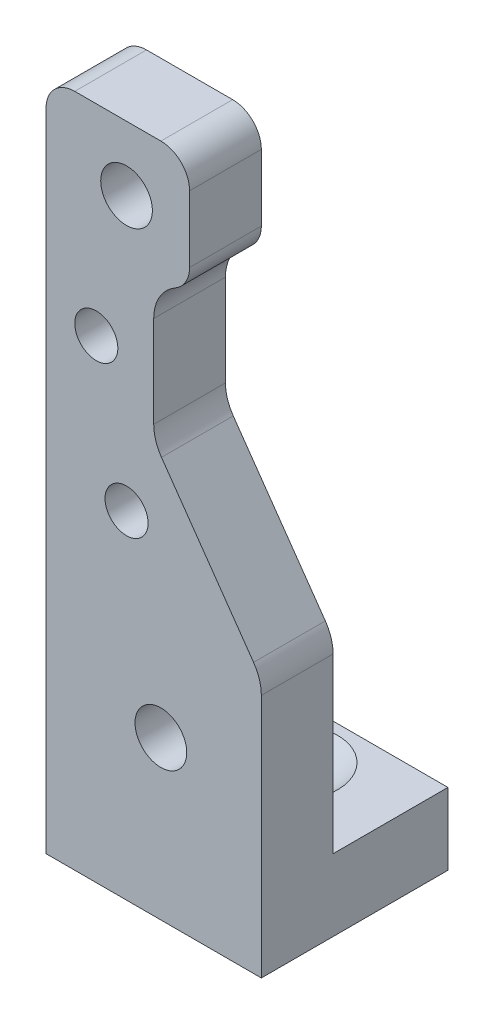
ISO-10303-21;
HEADER;
FILE_DESCRIPTION(('STEP AP214'),'2;1');
FILE_NAME('part.step','',(''),(''),'','','');
FILE_SCHEMA(('AUTOMOTIVE_DESIGN { 1 0 10303 214 1 1 1 1 }'));
ENDSEC;
DATA;
#1=APPLICATION_CONTEXT('core data for automotive mechanical design processes');
#2=APPLICATION_PROTOCOL_DEFINITION('international standard','automotive_design',2000,#1);
#3=PRODUCT_CONTEXT('',#1,'mechanical');
#4=PRODUCT('Part','Part','',(#3));
#5=PRODUCT_RELATED_PRODUCT_CATEGORY('part','',(#4));
#6=PRODUCT_DEFINITION_FORMATION('','',#4);
#7=PRODUCT_DEFINITION_CONTEXT('part definition',#1,'design');
#8=PRODUCT_DEFINITION('design','',#6,#7);
#9=PRODUCT_DEFINITION_SHAPE('','',#8);
#10=(LENGTH_UNIT() NAMED_UNIT(*) SI_UNIT(.MILLI.,.METRE.));
#11=(NAMED_UNIT(*) PLANE_ANGLE_UNIT() SI_UNIT($,.RADIAN.));
#12=(NAMED_UNIT(*) SI_UNIT($,.STERADIAN.) SOLID_ANGLE_UNIT());
#13=UNCERTAINTY_MEASURE_WITH_UNIT(LENGTH_MEASURE(1.E-05),#10,'distance_accuracy_value','');
#14=(GEOMETRIC_REPRESENTATION_CONTEXT(3) GLOBAL_UNCERTAINTY_ASSIGNED_CONTEXT((#13)) GLOBAL_UNIT_ASSIGNED_CONTEXT((#10,
#11,#12)) REPRESENTATION_CONTEXT('',''));
#15=CARTESIAN_POINT('',(0.,0.,0.));
#16=DIRECTION('',(0.,0.,1.));
#17=DIRECTION('',(1.,0.,0.));
#18=AXIS2_PLACEMENT_3D('',#15,#16,#17);
#19=CARTESIAN_POINT('',(-5.,5.,-13.));
#20=DIRECTION('',(0.,1.,0.));
#21=DIRECTION('',(0.,0.,1.));
#22=AXIS2_PLACEMENT_3D('',#19,#20,#21);
#23=PLANE('',#22);
#24=CARTESIAN_POINT('',(3.,5.,-9.));
#25=DIRECTION('',(0.,1.,0.));
#26=DIRECTION('',(0.,0.,1.));
#27=AXIS2_PLACEMENT_3D('',#24,#25,#26);
#28=CIRCLE('',#27,3.3);
#29=CARTESIAN_POINT('',(3.,5.,-5.7));
#30=VERTEX_POINT('',#29);
#31=EDGE_CURVE('E323',#30,#30,#28,.T.);
#32=ORIENTED_EDGE('',*,*,#31,.F.);
#33=EDGE_LOOP('',(#32));
#34=FACE_BOUND('',#33,.T.);
#35=DIRECTION('',(1.,0.,0.));
#36=VECTOR('',#35,1.);
#37=CARTESIAN_POINT('',(-5.,5.,-13.));
#38=LINE('',#37,#36);
#39=CARTESIAN_POINT('',(-2.,5.,-13.));
#40=VERTEX_POINT('',#39);
#41=CARTESIAN_POINT('',(10.,5.,-13.));
#42=VERTEX_POINT('',#41);
#43=EDGE_CURVE('E197',#40,#42,#38,.T.);
#44=ORIENTED_EDGE('',*,*,#43,.F.);
#45=DIRECTION('',(0.,0.,1.));
#46=VECTOR('',#45,1.);
#47=CARTESIAN_POINT('',(-2.,5.,-13.));
#48=LINE('',#47,#46);
#49=CARTESIAN_POINT('',(-2.,5.,-5.));
#50=VERTEX_POINT('',#49);
#51=EDGE_CURVE('E276',#40,#50,#48,.T.);
#52=ORIENTED_EDGE('',*,*,#51,.T.);
#53=DIRECTION('',(1.,0.,0.));
#54=VECTOR('',#53,1.);
#55=CARTESIAN_POINT('',(-5.,5.,-5.));
#56=LINE('',#55,#54);
#57=CARTESIAN_POINT('',(10.,5.,-5.));
#58=VERTEX_POINT('',#57);
#59=EDGE_CURVE('E192',#50,#58,#56,.T.);
#60=ORIENTED_EDGE('',*,*,#59,.T.);
#61=DIRECTION('',(0.,0.,1.));
#62=VECTOR('',#61,1.);
#63=CARTESIAN_POINT('',(10.,5.,-13.));
#64=LINE('',#63,#62);
#65=EDGE_CURVE('E177',#42,#58,#64,.T.);
#66=ORIENTED_EDGE('',*,*,#65,.F.);
#67=EDGE_LOOP('',(#44,#52,#60,#66));
#68=FACE_BOUND('',#67,.T.);
#69=ADVANCED_FACE('F33',(#34,#68),#23,.T.);
#70=CARTESIAN_POINT('',(-5.,0.,0.));
#71=DIRECTION('',(0.,0.,1.));
#72=DIRECTION('',(1.,0.,0.));
#73=AXIS2_PLACEMENT_3D('',#70,#71,#72);
#74=PLANE('',#73);
#75=CARTESIAN_POINT('',(-1.50000000000001,33.,0.));
#76=DIRECTION('',(0.,0.,-1.));
#77=DIRECTION('',(-1.,0.,0.));
#78=AXIS2_PLACEMENT_3D('',#75,#76,#77);
#79=CIRCLE('',#78,1.49999999999999);
#80=CARTESIAN_POINT('',(-3.,33.,0.));
#81=VERTEX_POINT('',#80);
#82=EDGE_CURVE('E311',#81,#81,#79,.T.);
#83=ORIENTED_EDGE('',*,*,#82,.T.);
#84=EDGE_LOOP('',(#83));
#85=FACE_BOUND('',#84,.T.);
#86=CARTESIAN_POINT('',(0.608074791675382,23.4910891108342,0.));
#87=DIRECTION('',(0.,0.,-1.));
#88=DIRECTION('',(-1.,0.,0.));
#89=AXIS2_PLACEMENT_3D('',#86,#87,#88);
#90=CIRCLE('',#89,1.49999999999999);
#91=CARTESIAN_POINT('',(-0.891925208324605,23.4910891108342,0.));
#92=VERTEX_POINT('',#91);
#93=EDGE_CURVE('E305',#92,#92,#90,.T.);
#94=ORIENTED_EDGE('',*,*,#93,.T.);
#95=EDGE_LOOP('',(#94));
#96=FACE_BOUND('',#95,.T.);
#97=CARTESIAN_POINT('',(3.,11.,0.));
#98=DIRECTION('',(0.,0.,-1.));
#99=DIRECTION('',(-1.,0.,0.));
#100=AXIS2_PLACEMENT_3D('',#97,#98,#99);
#101=CIRCLE('',#100,1.8);
#102=CARTESIAN_POINT('',(1.2,11.,0.));
#103=VERTEX_POINT('',#102);
#104=EDGE_CURVE('E296',#103,#103,#101,.T.);
#105=ORIENTED_EDGE('',*,*,#104,.T.);
#106=EDGE_LOOP('',(#105));
#107=FACE_BOUND('',#106,.T.);
#108=CARTESIAN_POINT('',(0.608074791675382,42.5089108891658,0.));
#109=DIRECTION('',(0.,0.,-1.));
#110=DIRECTION('',(-1.,0.,0.));
#111=AXIS2_PLACEMENT_3D('',#108,#109,#110);
#112=CIRCLE('',#111,1.8);
#113=CARTESIAN_POINT('',(-1.19192520832462,42.5089108891658,0.));
#114=VERTEX_POINT('',#113);
#115=EDGE_CURVE('E285',#114,#114,#112,.T.);
#116=ORIENTED_EDGE('',*,*,#115,.T.);
#117=EDGE_LOOP('',(#116));
#118=FACE_BOUND('',#117,.T.);
#119=DIRECTION('',(1.,0.,0.));
#120=VECTOR('',#119,1.);
#121=CARTESIAN_POINT('',(-5.,47.,0.));
#122=LINE('',#121,#120);
#123=CARTESIAN_POINT('',(-3.,47.,0.));
#124=VERTEX_POINT('',#123);
#125=CARTESIAN_POINT('',(3.,47.,0.));
#126=VERTEX_POINT('',#125);
#127=EDGE_CURVE('E267',#124,#126,#122,.T.);
#128=ORIENTED_EDGE('',*,*,#127,.F.);
#129=CARTESIAN_POINT('',(-3.,45.,0.));
#130=DIRECTION('',(0.,0.,1.));
#131=DIRECTION('',(1.,0.,0.));
#132=AXIS2_PLACEMENT_3D('',#129,#130,#131);
#133=CIRCLE('',#132,2.);
#134=CARTESIAN_POINT('',(-5.,45.,0.));
#135=VERTEX_POINT('',#134);
#136=EDGE_CURVE('E238',#124,#135,#133,.T.);
#137=ORIENTED_EDGE('',*,*,#136,.T.);
#138=DIRECTION('',(0.,-1.,0.));
#139=VECTOR('',#138,1.);
#140=CARTESIAN_POINT('',(-5.,0.,0.));
#141=LINE('',#140,#139);
#142=CARTESIAN_POINT('',(-5.,0.,0.));
#143=VERTEX_POINT('',#142);
#144=EDGE_CURVE('E167',#135,#143,#141,.T.);
#145=ORIENTED_EDGE('',*,*,#144,.T.);
#146=DIRECTION('',(1.,0.,0.));
#147=VECTOR('',#146,1.);
#148=CARTESIAN_POINT('',(-5.,0.,0.));
#149=LINE('',#148,#147);
#150=CARTESIAN_POINT('',(10.,0.,0.));
#151=VERTEX_POINT('',#150);
#152=EDGE_CURVE('E163',#143,#151,#149,.T.);
#153=ORIENTED_EDGE('',*,*,#152,.T.);
#154=DIRECTION('',(0.,-1.,0.));
#155=VECTOR('',#154,1.);
#156=CARTESIAN_POINT('',(10.,0.,0.));
#157=LINE('',#156,#155);
#158=CARTESIAN_POINT('',(10.,17.054103633363,0.));
#159=VERTEX_POINT('',#158);
#160=EDGE_CURVE('E150',#159,#151,#157,.T.);
#161=ORIENTED_EDGE('',*,*,#160,.F.);
#162=CARTESIAN_POINT('',(7.,17.054103633363,0.));
#163=DIRECTION('',(0.,0.,1.));
#164=DIRECTION('',(1.,0.,0.));
#165=AXIS2_PLACEMENT_3D('',#162,#163,#164);
#166=CIRCLE('',#165,3.);
#167=CARTESIAN_POINT('',(9.45745613286697,18.7748329424162,0.));
#168=VERTEX_POINT('',#167);
#169=EDGE_CURVE('E200',#159,#168,#166,.T.);
#170=ORIENTED_EDGE('',*,*,#169,.T.);
#171=DIRECTION('',(0.57357643635105,-0.819152044288989,0.));
#172=VECTOR('',#171,1.);
#173=CARTESIAN_POINT('',(2.5,28.7111100505657,0.));
#174=LINE('',#173,#172);
#175=CARTESIAN_POINT('',(3.04254386713303,27.9362771081496,0.));
#176=VERTEX_POINT('',#175);
#177=EDGE_CURVE('E160',#176,#168,#174,.T.);
#178=ORIENTED_EDGE('',*,*,#177,.F.);
#179=CARTESIAN_POINT('',(5.5,29.6570064172027,0.));
#180=DIRECTION('',(0.,0.,1.));
#181=DIRECTION('',(1.,0.,0.));
#182=AXIS2_PLACEMENT_3D('',#179,#180,#181);
#183=CIRCLE('',#182,3.);
#184=CARTESIAN_POINT('',(2.5,29.6570064172027,0.));
#185=VERTEX_POINT('',#184);
#186=EDGE_CURVE('E215',#176,#185,#183,.F.);
#187=ORIENTED_EDGE('',*,*,#186,.T.);
#188=DIRECTION('',(0.,-1.,0.));
#189=VECTOR('',#188,1.);
#190=CARTESIAN_POINT('',(2.5,39.,0.));
#191=LINE('',#190,#189);
#192=CARTESIAN_POINT('',(2.5,36.0419601084502,0.));
#193=VERTEX_POINT('',#192);
#194=EDGE_CURVE('E264',#193,#185,#191,.T.);
#195=ORIENTED_EDGE('',*,*,#194,.F.);
#196=CARTESIAN_POINT('',(5.5,36.0419601084502,0.));
#197=DIRECTION('',(0.,0.,1.));
#198=DIRECTION('',(1.,0.,0.));
#199=AXIS2_PLACEMENT_3D('',#196,#197,#198);
#200=CIRCLE('',#199,3.);
#201=CARTESIAN_POINT('',(4.,38.6400363198035,0.));
#202=VERTEX_POINT('',#201);
#203=EDGE_CURVE('E219',#193,#202,#200,.F.);
#204=ORIENTED_EDGE('',*,*,#203,.T.);
#205=CARTESIAN_POINT('',(3.,40.3720871273724,0.));
#206=DIRECTION('',(0.,0.,1.));
#207=DIRECTION('',(1.,0.,0.));
#208=AXIS2_PLACEMENT_3D('',#205,#206,#207);
#209=CIRCLE('',#208,2.);
#210=CARTESIAN_POINT('',(5.,40.3720871273724,0.));
#211=VERTEX_POINT('',#210);
#212=EDGE_CURVE('E48',#202,#211,#209,.T.);
#213=ORIENTED_EDGE('',*,*,#212,.T.);
#214=DIRECTION('',(0.,-1.,0.));
#215=VECTOR('',#214,1.);
#216=CARTESIAN_POINT('',(5.,47.,0.));
#217=LINE('',#216,#215);
#218=CARTESIAN_POINT('',(5.,45.,0.));
#219=VERTEX_POINT('',#218);
#220=EDGE_CURVE('E246',#219,#211,#217,.T.);
#221=ORIENTED_EDGE('',*,*,#220,.F.);
#222=CARTESIAN_POINT('',(3.,45.,0.));
#223=DIRECTION('',(0.,0.,1.));
#224=DIRECTION('',(1.,0.,0.));
#225=AXIS2_PLACEMENT_3D('',#222,#223,#224);
#226=CIRCLE('',#225,2.);
#227=EDGE_CURVE('E236',#219,#126,#226,.T.);
#228=ORIENTED_EDGE('',*,*,#227,.T.);
#229=EDGE_LOOP('',(#128,#137,#145,#153,#161,#170,#178,#187,#195,#204,#213,#221,#228));
#230=FACE_BOUND('',#229,.T.);
#231=ADVANCED_FACE('F165',(#85,#96,#107,#118,#230),#74,.T.);
#232=CARTESIAN_POINT('',(-5.,5.,-5.));
#233=DIRECTION('',(0.,0.,-1.));
#234=DIRECTION('',(-1.,0.,0.));
#235=AXIS2_PLACEMENT_3D('',#232,#233,#234);
#236=PLANE('',#235);
#237=CARTESIAN_POINT('',(-1.50000000000001,33.,-5.));
#238=DIRECTION('',(0.,0.,-1.));
#239=DIRECTION('',(-1.,0.,0.));
#240=AXIS2_PLACEMENT_3D('',#237,#238,#239);
#241=CIRCLE('',#240,1.49999999999999);
#242=CARTESIAN_POINT('',(-3.,33.,-5.));
#243=VERTEX_POINT('',#242);
#244=EDGE_CURVE('E314',#243,#243,#241,.T.);
#245=ORIENTED_EDGE('',*,*,#244,.F.);
#246=EDGE_LOOP('',(#245));
#247=FACE_BOUND('',#246,.T.);
#248=CARTESIAN_POINT('',(0.608074791675382,23.4910891108342,-5.));
#249=DIRECTION('',(0.,0.,-1.));
#250=DIRECTION('',(-1.,0.,0.));
#251=AXIS2_PLACEMENT_3D('',#248,#249,#250);
#252=CIRCLE('',#251,1.49999999999999);
#253=CARTESIAN_POINT('',(-0.891925208324606,23.4910891108342,-5.));
#254=VERTEX_POINT('',#253);
#255=EDGE_CURVE('E308',#254,#254,#252,.T.);
#256=ORIENTED_EDGE('',*,*,#255,.F.);
#257=EDGE_LOOP('',(#256));
#258=FACE_BOUND('',#257,.T.);
#259=CARTESIAN_POINT('',(3.,11.,-5.));
#260=DIRECTION('',(0.,0.,-1.));
#261=DIRECTION('',(-1.,0.,0.));
#262=AXIS2_PLACEMENT_3D('',#259,#260,#261);
#263=CIRCLE('',#262,3.3);
#264=CARTESIAN_POINT('',(-0.300000000000001,11.,-5.));
#265=VERTEX_POINT('',#264);
#266=EDGE_CURVE('E302',#265,#265,#263,.T.);
#267=ORIENTED_EDGE('',*,*,#266,.F.);
#268=EDGE_LOOP('',(#267));
#269=FACE_BOUND('',#268,.T.);
#270=CARTESIAN_POINT('',(0.608074791675382,42.5089108891658,-5.));
#271=DIRECTION('',(0.,0.,-1.));
#272=DIRECTION('',(-1.,0.,0.));
#273=AXIS2_PLACEMENT_3D('',#270,#271,#272);
#274=CIRCLE('',#273,3.3);
#275=CARTESIAN_POINT('',(-2.69192520832462,42.5089108891658,-5.));
#276=VERTEX_POINT('',#275);
#277=EDGE_CURVE('E293',#276,#276,#274,.T.);
#278=ORIENTED_EDGE('',*,*,#277,.F.);
#279=EDGE_LOOP('',(#278));
#280=FACE_BOUND('',#279,.T.);
#281=DIRECTION('',(0.,1.,0.));
#282=VECTOR('',#281,1.);
#283=CARTESIAN_POINT('',(-5.,5.,-5.));
#284=LINE('',#283,#282);
#285=CARTESIAN_POINT('',(-5.,15.,-5.));
#286=VERTEX_POINT('',#285);
#287=CARTESIAN_POINT('',(-5.,45.,-5.));
#288=VERTEX_POINT('',#287);
#289=EDGE_CURVE('E172',#286,#288,#284,.T.);
#290=ORIENTED_EDGE('',*,*,#289,.T.);
#291=CARTESIAN_POINT('',(-3.,45.,-5.));
#292=DIRECTION('',(0.,0.,-1.));
#293=DIRECTION('',(-1.,0.,0.));
#294=AXIS2_PLACEMENT_3D('',#291,#292,#293);
#295=CIRCLE('',#294,2.);
#296=CARTESIAN_POINT('',(-3.,47.,-5.));
#297=VERTEX_POINT('',#296);
#298=EDGE_CURVE('E228',#288,#297,#295,.T.);
#299=ORIENTED_EDGE('',*,*,#298,.T.);
#300=DIRECTION('',(1.,0.,0.));
#301=VECTOR('',#300,1.);
#302=CARTESIAN_POINT('',(-5.,47.,-5.));
#303=LINE('',#302,#301);
#304=CARTESIAN_POINT('',(3.,47.,-5.));
#305=VERTEX_POINT('',#304);
#306=EDGE_CURVE('E253',#297,#305,#303,.T.);
#307=ORIENTED_EDGE('',*,*,#306,.T.);
#308=CARTESIAN_POINT('',(3.,45.,-5.));
#309=DIRECTION('',(0.,0.,-1.));
#310=DIRECTION('',(-1.,0.,0.));
#311=AXIS2_PLACEMENT_3D('',#308,#309,#310);
#312=CIRCLE('',#311,2.);
#313=CARTESIAN_POINT('',(5.,45.,-5.));
#314=VERTEX_POINT('',#313);
#315=EDGE_CURVE('E226',#305,#314,#312,.T.);
#316=ORIENTED_EDGE('',*,*,#315,.T.);
#317=DIRECTION('',(0.,-1.,0.));
#318=VECTOR('',#317,1.);
#319=CARTESIAN_POINT('',(5.,47.,-5.));
#320=LINE('',#319,#318);
#321=CARTESIAN_POINT('',(5.,40.3720871273724,-5.));
#322=VERTEX_POINT('',#321);
#323=EDGE_CURVE('E245',#314,#322,#320,.T.);
#324=ORIENTED_EDGE('',*,*,#323,.T.);
#325=CARTESIAN_POINT('',(3.,40.3720871273724,-5.));
#326=DIRECTION('',(0.,0.,-1.));
#327=DIRECTION('',(-1.,0.,0.));
#328=AXIS2_PLACEMENT_3D('',#325,#326,#327);
#329=CIRCLE('',#328,2.);
#330=CARTESIAN_POINT('',(4.,38.6400363198035,-5.));
#331=VERTEX_POINT('',#330);
#332=EDGE_CURVE('E224',#322,#331,#329,.T.);
#333=ORIENTED_EDGE('',*,*,#332,.T.);
#334=CARTESIAN_POINT('',(5.5,36.0419601084502,-5.));
#335=DIRECTION('',(0.,0.,-1.));
#336=DIRECTION('',(-1.,0.,0.));
#337=AXIS2_PLACEMENT_3D('',#334,#335,#336);
#338=CIRCLE('',#337,3.);
#339=CARTESIAN_POINT('',(2.5,36.0419601084502,-5.));
#340=VERTEX_POINT('',#339);
#341=EDGE_CURVE('E217',#331,#340,#338,.F.);
#342=ORIENTED_EDGE('',*,*,#341,.T.);
#343=DIRECTION('',(0.,-1.,0.));
#344=VECTOR('',#343,1.);
#345=CARTESIAN_POINT('',(2.5,39.,-5.));
#346=LINE('',#345,#344);
#347=CARTESIAN_POINT('',(2.5,29.6570064172027,-5.));
#348=VERTEX_POINT('',#347);
#349=EDGE_CURVE('E252',#340,#348,#346,.T.);
#350=ORIENTED_EDGE('',*,*,#349,.T.);
#351=CARTESIAN_POINT('',(5.5,29.6570064172027,-5.));
#352=DIRECTION('',(0.,0.,-1.));
#353=DIRECTION('',(-1.,0.,0.));
#354=AXIS2_PLACEMENT_3D('',#351,#352,#353);
#355=CIRCLE('',#354,3.);
#356=CARTESIAN_POINT('',(3.04254386713303,27.9362771081496,-5.));
#357=VERTEX_POINT('',#356);
#358=EDGE_CURVE('E213',#348,#357,#355,.F.);
#359=ORIENTED_EDGE('',*,*,#358,.T.);
#360=DIRECTION('',(0.57357643635105,-0.819152044288989,0.));
#361=VECTOR('',#360,1.);
#362=CARTESIAN_POINT('',(2.5,28.7111100505657,-5.));
#363=LINE('',#362,#361);
#364=CARTESIAN_POINT('',(9.45745613286697,18.7748329424162,-5.));
#365=VERTEX_POINT('',#364);
#366=EDGE_CURVE('E256',#357,#365,#363,.T.);
#367=ORIENTED_EDGE('',*,*,#366,.T.);
#368=CARTESIAN_POINT('',(7.,17.054103633363,-5.));
#369=DIRECTION('',(0.,0.,-1.));
#370=DIRECTION('',(-1.,0.,0.));
#371=AXIS2_PLACEMENT_3D('',#368,#369,#370);
#372=CIRCLE('',#371,3.);
#373=CARTESIAN_POINT('',(10.,17.054103633363,-5.));
#374=VERTEX_POINT('',#373);
#375=EDGE_CURVE('E206',#365,#374,#372,.T.);
#376=ORIENTED_EDGE('',*,*,#375,.T.);
#377=DIRECTION('',(0.,1.,0.));
#378=VECTOR('',#377,1.);
#379=CARTESIAN_POINT('',(10.,5.,-5.));
#380=LINE('',#379,#378);
#381=EDGE_CURVE('E183',#58,#374,#380,.T.);
#382=ORIENTED_EDGE('',*,*,#381,.F.);
#383=ORIENTED_EDGE('',*,*,#59,.F.);
#384=DIRECTION('',(0.,1.,0.));
#385=VECTOR('',#384,1.);
#386=CARTESIAN_POINT('',(-2.,5.,-5.));
#387=LINE('',#386,#385);
#388=CARTESIAN_POINT('',(-2.,15.,-5.));
#389=VERTEX_POINT('',#388);
#390=EDGE_CURVE('E258',#50,#389,#387,.T.);
#391=ORIENTED_EDGE('',*,*,#390,.T.);
#392=DIRECTION('',(1.,0.,0.));
#393=VECTOR('',#392,1.);
#394=CARTESIAN_POINT('',(-5.,15.,-5.));
#395=LINE('',#394,#393);
#396=EDGE_CURVE('E278',#286,#389,#395,.T.);
#397=ORIENTED_EDGE('',*,*,#396,.F.);
#398=EDGE_LOOP('',(#290,#299,#307,#316,#324,#333,#342,#350,#359,#367,#376,#382,#383,#391,#397));
#399=FACE_BOUND('',#398,.T.);
#400=ADVANCED_FACE('F249',(#247,#258,#269,#280,#399),#236,.T.);
#401=CARTESIAN_POINT('',(-5.,0.,-13.));
#402=DIRECTION('',(0.,0.,-1.));
#403=DIRECTION('',(-1.,0.,0.));
#404=AXIS2_PLACEMENT_3D('',#401,#402,#403);
#405=PLANE('',#404);
#406=CARTESIAN_POINT('',(-5.,5.,-13.));
#407=VERTEX_POINT('',#406);
#408=EDGE_CURVE('E194',#407,#40,#38,.T.);
#409=ORIENTED_EDGE('',*,*,#408,.T.);
#410=ORIENTED_EDGE('',*,*,#43,.T.);
#411=DIRECTION('',(0.,1.,0.));
#412=VECTOR('',#411,1.);
#413=CARTESIAN_POINT('',(10.,0.,-13.));
#414=LINE('',#413,#412);
#415=CARTESIAN_POINT('',(10.,0.,-13.));
#416=VERTEX_POINT('',#415);
#417=EDGE_CURVE('E175',#416,#42,#414,.T.);
#418=ORIENTED_EDGE('',*,*,#417,.F.);
#419=DIRECTION('',(1.,0.,0.));
#420=VECTOR('',#419,1.);
#421=CARTESIAN_POINT('',(-5.,0.,-13.));
#422=LINE('',#421,#420);
#423=CARTESIAN_POINT('',(-5.,0.,-13.));
#424=VERTEX_POINT('',#423);
#425=EDGE_CURVE('E171',#424,#416,#422,.T.);
#426=ORIENTED_EDGE('',*,*,#425,.F.);
#427=DIRECTION('',(0.,1.,0.));
#428=VECTOR('',#427,1.);
#429=CARTESIAN_POINT('',(-5.,0.,-13.));
#430=LINE('',#429,#428);
#431=EDGE_CURVE('E188',#424,#407,#430,.T.);
#432=ORIENTED_EDGE('',*,*,#431,.T.);
#433=EDGE_LOOP('',(#409,#410,#418,#426,#432));
#434=FACE_BOUND('',#433,.T.);
#435=ADVANCED_FACE('F337',(#434),#405,.T.);
#436=CARTESIAN_POINT('',(-5.,0.,0.));
#437=DIRECTION('',(0.,-1.,0.));
#438=DIRECTION('',(0.,0.,-1.));
#439=AXIS2_PLACEMENT_3D('',#436,#437,#438);
#440=PLANE('',#439);
#441=CARTESIAN_POINT('',(3.,0.,-9.));
#442=DIRECTION('',(0.,1.,0.));
#443=DIRECTION('',(0.,0.,1.));
#444=AXIS2_PLACEMENT_3D('',#441,#442,#443);
#445=CIRCLE('',#444,1.8);
#446=CARTESIAN_POINT('',(3.,0.,-7.2));
#447=VERTEX_POINT('',#446);
#448=EDGE_CURVE('E317',#447,#447,#445,.T.);
#449=ORIENTED_EDGE('',*,*,#448,.T.);
#450=EDGE_LOOP('',(#449));
#451=FACE_BOUND('',#450,.T.);
#452=ORIENTED_EDGE('',*,*,#425,.T.);
#453=DIRECTION('',(0.,0.,-1.));
#454=VECTOR('',#453,1.);
#455=CARTESIAN_POINT('',(10.,0.,0.));
#456=LINE('',#455,#454);
#457=EDGE_CURVE('E156',#151,#416,#456,.T.);
#458=ORIENTED_EDGE('',*,*,#457,.F.);
#459=ORIENTED_EDGE('',*,*,#152,.F.);
#460=DIRECTION('',(0.,0.,-1.));
#461=VECTOR('',#460,1.);
#462=CARTESIAN_POINT('',(-5.,0.,0.));
#463=LINE('',#462,#461);
#464=EDGE_CURVE('E186',#143,#424,#463,.T.);
#465=ORIENTED_EDGE('',*,*,#464,.T.);
#466=EDGE_LOOP('',(#452,#458,#459,#465));
#467=FACE_BOUND('',#466,.T.);
#468=ADVANCED_FACE('F174',(#451,#467),#440,.T.);
#469=CARTESIAN_POINT('',(-5.,0.,0.));
#470=DIRECTION('',(-1.,0.,0.));
#471=DIRECTION('',(0.,0.,1.));
#472=AXIS2_PLACEMENT_3D('',#469,#470,#471);
#473=PLANE('',#472);
#474=ORIENTED_EDGE('',*,*,#144,.F.);
#475=DIRECTION('',(0.,0.,-1.));
#476=VECTOR('',#475,1.);
#477=CARTESIAN_POINT('',(-5.,45.,0.));
#478=LINE('',#477,#476);
#479=EDGE_CURVE('E221',#135,#288,#478,.T.);
#480=ORIENTED_EDGE('',*,*,#479,.T.);
#481=ORIENTED_EDGE('',*,*,#289,.F.);
#482=DIRECTION('',(0.,-0.78086880944303,-0.624695047554425));
#483=VECTOR('',#482,1.);
#484=CARTESIAN_POINT('',(-5.,15.,-5.));
#485=LINE('',#484,#483);
#486=EDGE_CURVE('E281',#286,#407,#485,.T.);
#487=ORIENTED_EDGE('',*,*,#486,.T.);
#488=ORIENTED_EDGE('',*,*,#431,.F.);
#489=ORIENTED_EDGE('',*,*,#464,.F.);
#490=EDGE_LOOP('',(#474,#480,#481,#487,#488,#489));
#491=FACE_BOUND('',#490,.T.);
#492=ADVANCED_FACE('F348',(#491),#473,.T.);
#493=CARTESIAN_POINT('',(10.,0.,0.));
#494=DIRECTION('',(-1.,0.,0.));
#495=DIRECTION('',(0.,0.,1.));
#496=AXIS2_PLACEMENT_3D('',#493,#494,#495);
#497=PLANE('',#496);
#498=ORIENTED_EDGE('',*,*,#381,.T.);
#499=DIRECTION('',(0.,0.,1.));
#500=VECTOR('',#499,1.);
#501=CARTESIAN_POINT('',(10.,17.054103633363,0.));
#502=LINE('',#501,#500);
#503=EDGE_CURVE('E159',#374,#159,#502,.T.);
#504=ORIENTED_EDGE('',*,*,#503,.T.);
#505=ORIENTED_EDGE('',*,*,#160,.T.);
#506=ORIENTED_EDGE('',*,*,#457,.T.);
#507=ORIENTED_EDGE('',*,*,#417,.T.);
#508=ORIENTED_EDGE('',*,*,#65,.T.);
#509=EDGE_LOOP('',(#498,#504,#505,#506,#507,#508));
#510=FACE_BOUND('',#509,.T.);
#511=ADVANCED_FACE('F153',(#510),#497,.F.);
#512=CARTESIAN_POINT('',(-5.,47.,32.649655434629));
#513=DIRECTION('',(0.,1.,0.));
#514=DIRECTION('',(0.,0.,1.));
#515=AXIS2_PLACEMENT_3D('',#512,#513,#514);
#516=PLANE('',#515);
#517=ORIENTED_EDGE('',*,*,#306,.F.);
#518=DIRECTION('',(0.,0.,-1.));
#519=VECTOR('',#518,1.);
#520=CARTESIAN_POINT('',(-3.,47.,32.649655434629));
#521=LINE('',#520,#519);
#522=EDGE_CURVE('E233',#297,#124,#521,.F.);
#523=ORIENTED_EDGE('',*,*,#522,.T.);
#524=ORIENTED_EDGE('',*,*,#127,.T.);
#525=DIRECTION('',(0.,0.,-1.));
#526=VECTOR('',#525,1.);
#527=CARTESIAN_POINT('',(3.,47.,32.649655434629));
#528=LINE('',#527,#526);
#529=EDGE_CURVE('E230',#126,#305,#528,.T.);
#530=ORIENTED_EDGE('',*,*,#529,.T.);
#531=EDGE_LOOP('',(#517,#523,#524,#530));
#532=FACE_BOUND('',#531,.T.);
#533=ADVANCED_FACE('F355',(#532),#516,.T.);
#534=CARTESIAN_POINT('',(5.,47.,32.649655434629));
#535=DIRECTION('',(1.,0.,0.));
#536=DIRECTION('',(0.,1.,0.));
#537=AXIS2_PLACEMENT_3D('',#534,#535,#536);
#538=PLANE('',#537);
#539=ORIENTED_EDGE('',*,*,#323,.F.);
#540=DIRECTION('',(0.,0.,-1.));
#541=VECTOR('',#540,1.);
#542=CARTESIAN_POINT('',(5.,45.,32.649655434629));
#543=LINE('',#542,#541);
#544=EDGE_CURVE('E41',#314,#219,#543,.F.);
#545=ORIENTED_EDGE('',*,*,#544,.T.);
#546=ORIENTED_EDGE('',*,*,#220,.T.);
#547=DIRECTION('',(0.,0.,-1.));
#548=VECTOR('',#547,1.);
#549=CARTESIAN_POINT('',(5.,40.3720871273724,-5.));
#550=LINE('',#549,#548);
#551=EDGE_CURVE('E240',#211,#322,#550,.T.);
#552=ORIENTED_EDGE('',*,*,#551,.T.);
#553=EDGE_LOOP('',(#539,#545,#546,#552));
#554=FACE_BOUND('',#553,.T.);
#555=ADVANCED_FACE('F244',(#554),#538,.T.);
#556=CARTESIAN_POINT('',(2.5,39.,32.649655434629));
#557=DIRECTION('',(1.,0.,0.));
#558=DIRECTION('',(0.,1.,0.));
#559=AXIS2_PLACEMENT_3D('',#556,#557,#558);
#560=PLANE('',#559);
#561=ORIENTED_EDGE('',*,*,#194,.T.);
#562=DIRECTION('',(0.,0.,-1.));
#563=VECTOR('',#562,1.);
#564=CARTESIAN_POINT('',(2.5,29.6570064172027,-5.));
#565=LINE('',#564,#563);
#566=EDGE_CURVE('E210',#185,#348,#565,.T.);
#567=ORIENTED_EDGE('',*,*,#566,.T.);
#568=ORIENTED_EDGE('',*,*,#349,.F.);
#569=DIRECTION('',(0.,0.,-1.));
#570=VECTOR('',#569,1.);
#571=CARTESIAN_POINT('',(2.5,36.0419601084502,0.));
#572=LINE('',#571,#570);
#573=EDGE_CURVE('E208',#340,#193,#572,.F.);
#574=ORIENTED_EDGE('',*,*,#573,.T.);
#575=EDGE_LOOP('',(#561,#567,#568,#574));
#576=FACE_BOUND('',#575,.T.);
#577=ADVANCED_FACE('F399',(#576),#560,.T.);
#578=CARTESIAN_POINT('',(2.5,28.7111100505657,32.649655434629));
#579=DIRECTION('',(0.819152044288989,0.57357643635105,0.));
#580=DIRECTION('',(-0.57357643635105,0.819152044288989,0.));
#581=AXIS2_PLACEMENT_3D('',#578,#579,#580);
#582=PLANE('',#581);
#583=ORIENTED_EDGE('',*,*,#177,.T.);
#584=DIRECTION('',(0.,0.,1.));
#585=VECTOR('',#584,1.);
#586=CARTESIAN_POINT('',(9.45745613286697,18.7748329424162,-5.));
#587=LINE('',#586,#585);
#588=EDGE_CURVE('E204',#168,#365,#587,.F.);
#589=ORIENTED_EDGE('',*,*,#588,.T.);
#590=ORIENTED_EDGE('',*,*,#366,.F.);
#591=DIRECTION('',(0.,0.,-1.));
#592=VECTOR('',#591,1.);
#593=CARTESIAN_POINT('',(3.04254386713303,27.9362771081496,0.));
#594=LINE('',#593,#592);
#595=EDGE_CURVE('E202',#357,#176,#594,.F.);
#596=ORIENTED_EDGE('',*,*,#595,.T.);
#597=EDGE_LOOP('',(#583,#589,#590,#596));
#598=FACE_BOUND('',#597,.T.);
#599=ADVANCED_FACE('F402',(#598),#582,.T.);
#600=CARTESIAN_POINT('',(-5.,15.,-5.));
#601=DIRECTION('',(0.,0.624695047554425,-0.78086880944303));
#602=DIRECTION('',(0.,-0.78086880944303,-0.624695047554425));
#603=AXIS2_PLACEMENT_3D('',#600,#601,#602);
#604=PLANE('',#603);
#605=ORIENTED_EDGE('',*,*,#486,.F.);
#606=ORIENTED_EDGE('',*,*,#396,.T.);
#607=DIRECTION('',(0.,-0.78086880944303,-0.624695047554425));
#608=VECTOR('',#607,1.);
#609=CARTESIAN_POINT('',(-2.,15.,-5.));
#610=LINE('',#609,#608);
#611=EDGE_CURVE('E282',#389,#40,#610,.T.);
#612=ORIENTED_EDGE('',*,*,#611,.T.);
#613=ORIENTED_EDGE('',*,*,#408,.F.);
#614=EDGE_LOOP('',(#605,#606,#612,#613));
#615=FACE_BOUND('',#614,.T.);
#616=ADVANCED_FACE('F345',(#615),#604,.T.);
#617=CARTESIAN_POINT('',(-2.,23.5,-6.5));
#618=DIRECTION('',(-1.,0.,0.));
#619=DIRECTION('',(0.,0.,1.));
#620=AXIS2_PLACEMENT_3D('',#617,#618,#619);
#621=PLANE('',#620);
#622=ORIENTED_EDGE('',*,*,#390,.F.);
#623=ORIENTED_EDGE('',*,*,#51,.F.);
#624=ORIENTED_EDGE('',*,*,#611,.F.);
#625=EDGE_LOOP('',(#622,#623,#624));
#626=FACE_BOUND('',#625,.T.);
#627=ADVANCED_FACE('F344',(#626),#621,.F.);
#628=CARTESIAN_POINT('',(0.608074791675382,42.5089108891658,-5.));
#629=DIRECTION('',(0.,0.,-1.));
#630=DIRECTION('',(-1.,0.,0.));
#631=AXIS2_PLACEMENT_3D('',#628,#629,#630);
#632=CYLINDRICAL_SURFACE('',#631,1.8);
#633=ORIENTED_EDGE('',*,*,#115,.F.);
#634=EDGE_LOOP('',(#633));
#635=FACE_BOUND('',#634,.T.);
#636=CARTESIAN_POINT('',(0.608074791675382,42.5089108891658,-3.5));
#637=DIRECTION('',(0.,0.,-1.));
#638=DIRECTION('',(-1.,0.,0.));
#639=AXIS2_PLACEMENT_3D('',#636,#637,#638);
#640=CIRCLE('',#639,1.8);
#641=CARTESIAN_POINT('',(-1.19192520832462,42.5089108891658,-3.5));
#642=VERTEX_POINT('',#641);
#643=EDGE_CURVE('E290',#642,#642,#640,.T.);
#644=ORIENTED_EDGE('',*,*,#643,.T.);
#645=EDGE_LOOP('',(#644));
#646=FACE_BOUND('',#645,.T.);
#647=ADVANCED_FACE('F411',(#635,#646),#632,.F.);
#648=CARTESIAN_POINT('',(0.608074791675382,42.5089108891658,-5.));
#649=DIRECTION('',(0.,0.,-1.));
#650=DIRECTION('',(-1.,0.,0.));
#651=AXIS2_PLACEMENT_3D('',#648,#649,#650);
#652=CONICAL_SURFACE('',#651,3.3,0.785398163397449);
#653=ORIENTED_EDGE('',*,*,#643,.F.);
#654=EDGE_LOOP('',(#653));
#655=FACE_BOUND('',#654,.T.);
#656=ORIENTED_EDGE('',*,*,#277,.T.);
#657=EDGE_LOOP('',(#656));
#658=FACE_BOUND('',#657,.T.);
#659=ADVANCED_FACE('F414',(#655,#658),#652,.F.);
#660=CARTESIAN_POINT('',(3.,11.,-5.));
#661=DIRECTION('',(0.,0.,-1.));
#662=DIRECTION('',(-1.,0.,0.));
#663=AXIS2_PLACEMENT_3D('',#660,#661,#662);
#664=CYLINDRICAL_SURFACE('',#663,1.8);
#665=ORIENTED_EDGE('',*,*,#104,.F.);
#666=EDGE_LOOP('',(#665));
#667=FACE_BOUND('',#666,.T.);
#668=CARTESIAN_POINT('',(3.,11.,-3.5));
#669=DIRECTION('',(0.,0.,-1.));
#670=DIRECTION('',(-1.,0.,0.));
#671=AXIS2_PLACEMENT_3D('',#668,#669,#670);
#672=CIRCLE('',#671,1.8);
#673=CARTESIAN_POINT('',(1.2,11.,-3.5));
#674=VERTEX_POINT('',#673);
#675=EDGE_CURVE('E299',#674,#674,#672,.T.);
#676=ORIENTED_EDGE('',*,*,#675,.T.);
#677=EDGE_LOOP('',(#676));
#678=FACE_BOUND('',#677,.T.);
#679=ADVANCED_FACE('F418',(#667,#678),#664,.F.);
#680=CARTESIAN_POINT('',(3.,11.,-5.));
#681=DIRECTION('',(0.,0.,-1.));
#682=DIRECTION('',(-1.,0.,0.));
#683=AXIS2_PLACEMENT_3D('',#680,#681,#682);
#684=CONICAL_SURFACE('',#683,3.3,0.785398163397449);
#685=ORIENTED_EDGE('',*,*,#675,.F.);
#686=EDGE_LOOP('',(#685));
#687=FACE_BOUND('',#686,.T.);
#688=ORIENTED_EDGE('',*,*,#266,.T.);
#689=EDGE_LOOP('',(#688));
#690=FACE_BOUND('',#689,.T.);
#691=ADVANCED_FACE('F422',(#687,#690),#684,.F.);
#692=CARTESIAN_POINT('',(0.608074791675382,23.4910891108342,-5.));
#693=DIRECTION('',(0.,0.,-1.));
#694=DIRECTION('',(-1.,0.,0.));
#695=AXIS2_PLACEMENT_3D('',#692,#693,#694);
#696=CYLINDRICAL_SURFACE('',#695,1.49999999999999);
#697=ORIENTED_EDGE('',*,*,#93,.F.);
#698=EDGE_LOOP('',(#697));
#699=FACE_BOUND('',#698,.T.);
#700=ORIENTED_EDGE('',*,*,#255,.T.);
#701=EDGE_LOOP('',(#700));
#702=FACE_BOUND('',#701,.T.);
#703=ADVANCED_FACE('F426',(#699,#702),#696,.F.);
#704=CARTESIAN_POINT('',(-1.50000000000001,33.,-5.));
#705=DIRECTION('',(0.,0.,-1.));
#706=DIRECTION('',(-1.,0.,0.));
#707=AXIS2_PLACEMENT_3D('',#704,#705,#706);
#708=CYLINDRICAL_SURFACE('',#707,1.49999999999999);
#709=ORIENTED_EDGE('',*,*,#82,.F.);
#710=EDGE_LOOP('',(#709));
#711=FACE_BOUND('',#710,.T.);
#712=ORIENTED_EDGE('',*,*,#244,.T.);
#713=EDGE_LOOP('',(#712));
#714=FACE_BOUND('',#713,.T.);
#715=ADVANCED_FACE('F378',(#711,#714),#708,.F.);
#716=CARTESIAN_POINT('',(7.,17.054103633363,0.));
#717=DIRECTION('',(0.,0.,-1.));
#718=DIRECTION('',(-1.,0.,0.));
#719=AXIS2_PLACEMENT_3D('',#716,#717,#718);
#720=CYLINDRICAL_SURFACE('',#719,3.);
#721=ORIENTED_EDGE('',*,*,#375,.F.);
#722=ORIENTED_EDGE('',*,*,#588,.F.);
#723=ORIENTED_EDGE('',*,*,#169,.F.);
#724=ORIENTED_EDGE('',*,*,#503,.F.);
#725=EDGE_LOOP('',(#721,#722,#723,#724));
#726=FACE_BOUND('',#725,.T.);
#727=ADVANCED_FACE('F374',(#726),#720,.T.);
#728=CARTESIAN_POINT('',(5.5,29.6570064172027,32.649655434629));
#729=DIRECTION('',(0.,0.,1.));
#730=DIRECTION('',(1.,0.,0.));
#731=AXIS2_PLACEMENT_3D('',#728,#729,#730);
#732=CYLINDRICAL_SURFACE('',#731,3.);
#733=ORIENTED_EDGE('',*,*,#186,.F.);
#734=ORIENTED_EDGE('',*,*,#595,.F.);
#735=ORIENTED_EDGE('',*,*,#358,.F.);
#736=ORIENTED_EDGE('',*,*,#566,.F.);
#737=EDGE_LOOP('',(#733,#734,#735,#736));
#738=FACE_BOUND('',#737,.T.);
#739=ADVANCED_FACE('F370',(#738),#732,.F.);
#740=CARTESIAN_POINT('',(5.5,36.0419601084502,32.649655434629));
#741=DIRECTION('',(0.,0.,1.));
#742=DIRECTION('',(1.,0.,0.));
#743=AXIS2_PLACEMENT_3D('',#740,#741,#742);
#744=CYLINDRICAL_SURFACE('',#743,3.);
#745=ORIENTED_EDGE('',*,*,#341,.F.);
#746=DIRECTION('',(0.,0.,1.));
#747=VECTOR('',#746,1.);
#748=CARTESIAN_POINT('',(4.,38.6400363198035,32.649655434629));
#749=LINE('',#748,#747);
#750=EDGE_CURVE('E11',#331,#202,#749,.T.);
#751=ORIENTED_EDGE('',*,*,#750,.T.);
#752=ORIENTED_EDGE('',*,*,#203,.F.);
#753=ORIENTED_EDGE('',*,*,#573,.F.);
#754=EDGE_LOOP('',(#745,#751,#752,#753));
#755=FACE_BOUND('',#754,.T.);
#756=ADVANCED_FACE('F365',(#755),#744,.F.);
#757=CARTESIAN_POINT('',(-3.,45.,0.));
#758=DIRECTION('',(0.,0.,-1.));
#759=DIRECTION('',(-1.,0.,0.));
#760=AXIS2_PLACEMENT_3D('',#757,#758,#759);
#761=CYLINDRICAL_SURFACE('',#760,2.);
#762=ORIENTED_EDGE('',*,*,#136,.F.);
#763=ORIENTED_EDGE('',*,*,#522,.F.);
#764=ORIENTED_EDGE('',*,*,#298,.F.);
#765=ORIENTED_EDGE('',*,*,#479,.F.);
#766=EDGE_LOOP('',(#762,#763,#764,#765));
#767=FACE_BOUND('',#766,.T.);
#768=ADVANCED_FACE('F352',(#767),#761,.T.);
#769=CARTESIAN_POINT('',(3.,45.,32.649655434629));
#770=DIRECTION('',(0.,0.,-1.));
#771=DIRECTION('',(-1.,0.,0.));
#772=AXIS2_PLACEMENT_3D('',#769,#770,#771);
#773=CYLINDRICAL_SURFACE('',#772,2.);
#774=ORIENTED_EDGE('',*,*,#227,.F.);
#775=ORIENTED_EDGE('',*,*,#544,.F.);
#776=ORIENTED_EDGE('',*,*,#315,.F.);
#777=ORIENTED_EDGE('',*,*,#529,.F.);
#778=EDGE_LOOP('',(#774,#775,#776,#777));
#779=FACE_BOUND('',#778,.T.);
#780=ADVANCED_FACE('F358',(#779),#773,.T.);
#781=CARTESIAN_POINT('',(3.,40.3720871273724,32.649655434629));
#782=DIRECTION('',(0.,0.,1.));
#783=DIRECTION('',(1.,0.,0.));
#784=AXIS2_PLACEMENT_3D('',#781,#782,#783);
#785=CYLINDRICAL_SURFACE('',#784,2.);
#786=ORIENTED_EDGE('',*,*,#212,.F.);
#787=ORIENTED_EDGE('',*,*,#750,.F.);
#788=ORIENTED_EDGE('',*,*,#332,.F.);
#789=ORIENTED_EDGE('',*,*,#551,.F.);
#790=EDGE_LOOP('',(#786,#787,#788,#789));
#791=FACE_BOUND('',#790,.T.);
#792=ADVANCED_FACE('F35',(#791),#785,.T.);
#793=CARTESIAN_POINT('',(3.,5.,-9.));
#794=DIRECTION('',(0.,1.,0.));
#795=DIRECTION('',(0.,0.,1.));
#796=AXIS2_PLACEMENT_3D('',#793,#794,#795);
#797=CYLINDRICAL_SURFACE('',#796,1.8);
#798=ORIENTED_EDGE('',*,*,#448,.F.);
#799=EDGE_LOOP('',(#798));
#800=FACE_BOUND('',#799,.T.);
#801=CARTESIAN_POINT('',(3.,3.5,-9.));
#802=DIRECTION('',(0.,1.,0.));
#803=DIRECTION('',(0.,0.,1.));
#804=AXIS2_PLACEMENT_3D('',#801,#802,#803);
#805=CIRCLE('',#804,1.8);
#806=CARTESIAN_POINT('',(3.,3.5,-7.2));
#807=VERTEX_POINT('',#806);
#808=EDGE_CURVE('E320',#807,#807,#805,.T.);
#809=ORIENTED_EDGE('',*,*,#808,.T.);
#810=EDGE_LOOP('',(#809));
#811=FACE_BOUND('',#810,.T.);
#812=ADVANCED_FACE('F364',(#800,#811),#797,.F.);
#813=CARTESIAN_POINT('',(3.,5.,-9.));
#814=DIRECTION('',(0.,1.,0.));
#815=DIRECTION('',(0.,0.,1.));
#816=AXIS2_PLACEMENT_3D('',#813,#814,#815);
#817=CONICAL_SURFACE('',#816,3.3,0.785398163397448);
#818=ORIENTED_EDGE('',*,*,#808,.F.);
#819=EDGE_LOOP('',(#818));
#820=FACE_BOUND('',#819,.T.);
#821=ORIENTED_EDGE('',*,*,#31,.T.);
#822=EDGE_LOOP('',(#821));
#823=FACE_BOUND('',#822,.T.);
#824=ADVANCED_FACE('F327',(#820,#823),#817,.F.);
#825=CLOSED_SHELL('',(#69,#231,#400,#435,#468,#492,#511,#533,#555,#577,#599,#616,#627,#647,#659,
#679,#691,#703,#715,#727,#739,#756,#768,#780,#792,#812,#824));
#826=MANIFOLD_SOLID_BREP('B2',#825);
#827=ADVANCED_BREP_SHAPE_REPRESENTATION('',(#18,#826),#14);
#828=SHAPE_DEFINITION_REPRESENTATION(#9,#827);
ENDSEC;
END-ISO-10303-21;
